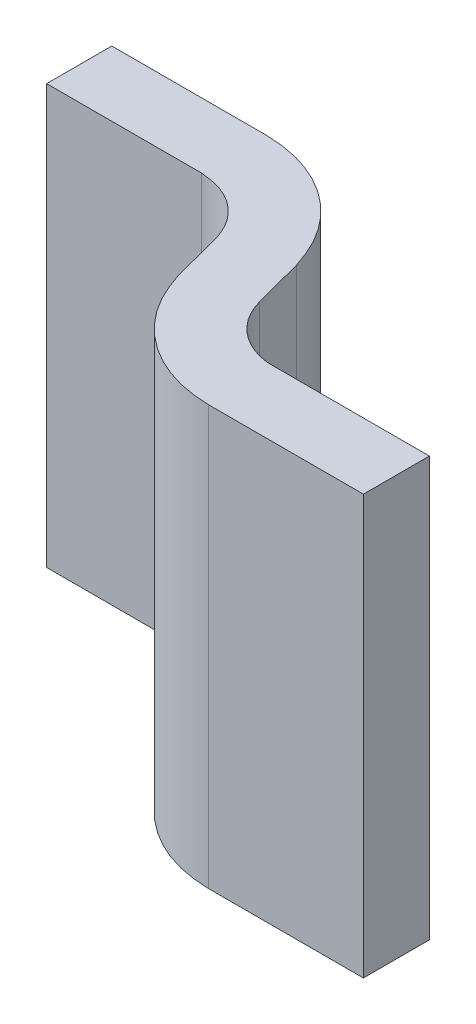
ISO-10303-21;
HEADER;
FILE_DESCRIPTION(('STEP AP214'),'2;1');
FILE_NAME('part.step','',(''),(''),'','','');
FILE_SCHEMA(('AUTOMOTIVE_DESIGN { 1 0 10303 214 1 1 1 1 }'));
ENDSEC;
DATA;
#1=APPLICATION_CONTEXT('core data for automotive mechanical design processes');
#2=APPLICATION_PROTOCOL_DEFINITION('international standard','automotive_design',2000,#1);
#3=PRODUCT_CONTEXT('',#1,'mechanical');
#4=PRODUCT('Part','Part','',(#3));
#5=PRODUCT_RELATED_PRODUCT_CATEGORY('part','',(#4));
#6=PRODUCT_DEFINITION_FORMATION('','',#4);
#7=PRODUCT_DEFINITION_CONTEXT('part definition',#1,'design');
#8=PRODUCT_DEFINITION('design','',#6,#7);
#9=PRODUCT_DEFINITION_SHAPE('','',#8);
#10=(LENGTH_UNIT() NAMED_UNIT(*) SI_UNIT(.MILLI.,.METRE.));
#11=(NAMED_UNIT(*) PLANE_ANGLE_UNIT() SI_UNIT($,.RADIAN.));
#12=(NAMED_UNIT(*) SI_UNIT($,.STERADIAN.) SOLID_ANGLE_UNIT());
#13=UNCERTAINTY_MEASURE_WITH_UNIT(LENGTH_MEASURE(1.E-05),#10,'distance_accuracy_value','');
#14=(GEOMETRIC_REPRESENTATION_CONTEXT(3) GLOBAL_UNCERTAINTY_ASSIGNED_CONTEXT((#13)) GLOBAL_UNIT_ASSIGNED_CONTEXT((#10,
#11,#12)) REPRESENTATION_CONTEXT('',''));
#15=CARTESIAN_POINT('',(0.,0.,0.));
#16=DIRECTION('',(0.,0.,1.));
#17=DIRECTION('',(1.,0.,0.));
#18=AXIS2_PLACEMENT_3D('',#15,#16,#17);
#19=CARTESIAN_POINT('',(-0.876,-0.254,0.238));
#20=DIRECTION('',(1.,0.,0.));
#21=DIRECTION('',(0.,0.,1.));
#22=AXIS2_PLACEMENT_3D('',#19,#20,#21);
#23=PLANE('',#22);
#24=DIRECTION('',(0.,-1.,0.));
#25=VECTOR('',#24,1.);
#26=CARTESIAN_POINT('',(-0.876,0.254,0.238));
#27=LINE('',#26,#25);
#28=CARTESIAN_POINT('',(-0.876,0.254,0.238));
#29=VERTEX_POINT('',#28);
#30=CARTESIAN_POINT('',(-0.876,-0.254,0.238));
#31=VERTEX_POINT('',#30);
#32=EDGE_CURVE('E11',#29,#31,#27,.T.);
#33=ORIENTED_EDGE('',*,*,#32,.F.);
#34=DIRECTION('',(0.,0.,-1.));
#35=VECTOR('',#34,1.);
#36=CARTESIAN_POINT('',(-0.876,0.254,0.318));
#37=LINE('',#36,#35);
#38=CARTESIAN_POINT('',(-0.876,0.254,0.318));
#39=VERTEX_POINT('',#38);
#40=EDGE_CURVE('E24',#39,#29,#37,.T.);
#41=ORIENTED_EDGE('',*,*,#40,.F.);
#42=DIRECTION('',(0.,1.,0.));
#43=VECTOR('',#42,1.);
#44=CARTESIAN_POINT('',(-0.876,-0.254,0.318));
#45=LINE('',#44,#43);
#46=CARTESIAN_POINT('',(-0.876,-0.254,0.318));
#47=VERTEX_POINT('',#46);
#48=EDGE_CURVE('E439',#47,#39,#45,.T.);
#49=ORIENTED_EDGE('',*,*,#48,.F.);
#50=DIRECTION('',(0.,0.,1.));
#51=VECTOR('',#50,1.);
#52=CARTESIAN_POINT('',(-0.876,-0.254,0.238));
#53=LINE('',#52,#51);
#54=EDGE_CURVE('E437',#31,#47,#53,.T.);
#55=ORIENTED_EDGE('',*,*,#54,.F.);
#56=EDGE_LOOP('',(#33,#41,#49,#55));
#57=FACE_BOUND('',#56,.T.);
#58=ADVANCED_FACE('F17',(#57),#23,.T.);
#59=CARTESIAN_POINT('',(-0.876,-0.254,0.318));
#60=DIRECTION('',(0.,0.,1.));
#61=DIRECTION('',(0.,1.,0.));
#62=AXIS2_PLACEMENT_3D('',#59,#60,#61);
#63=PLANE('',#62);
#64=ORIENTED_EDGE('',*,*,#48,.T.);
#65=DIRECTION('',(1.,0.,0.));
#66=VECTOR('',#65,1.);
#67=CARTESIAN_POINT('',(-1.064,0.254,0.318));
#68=LINE('',#67,#66);
#69=CARTESIAN_POINT('',(-1.064,0.254,0.318));
#70=VERTEX_POINT('',#69);
#71=EDGE_CURVE('E435',#70,#39,#68,.T.);
#72=ORIENTED_EDGE('',*,*,#71,.F.);
#73=CARTESIAN_POINT('',(-1.064,-0.254,0.31775));
#74=DIRECTION('',(0.,1.,0.));
#75=VECTOR('',#74,1.);
#76=LINE('',#73,#75);
#77=CARTESIAN_POINT('',(-1.064,-0.254,0.318));
#78=VERTEX_POINT('',#77);
#79=EDGE_CURVE('E257',#78,#70,#76,.T.);
#80=ORIENTED_EDGE('',*,*,#79,.F.);
#81=DIRECTION('',(-1.,0.,0.));
#82=VECTOR('',#81,1.);
#83=CARTESIAN_POINT('',(-0.876,-0.254,0.318));
#84=LINE('',#83,#82);
#85=EDGE_CURVE('E247',#47,#78,#84,.T.);
#86=ORIENTED_EDGE('',*,*,#85,.F.);
#87=EDGE_LOOP('',(#64,#72,#80,#86));
#88=FACE_BOUND('',#87,.T.);
#89=ADVANCED_FACE('F237',(#88),#63,.T.);
#90=CARTESIAN_POINT('',(-0.876,0.254,0.238));
#91=DIRECTION('',(0.,0.,-1.));
#92=DIRECTION('',(0.,1.,0.));
#93=AXIS2_PLACEMENT_3D('',#90,#91,#92);
#94=PLANE('',#93);
#95=ORIENTED_EDGE('',*,*,#32,.T.);
#96=DIRECTION('',(1.,0.,0.));
#97=VECTOR('',#96,1.);
#98=CARTESIAN_POINT('',(-1.064,-0.254,0.238));
#99=LINE('',#98,#97);
#100=CARTESIAN_POINT('',(-1.064,-0.254,0.238));
#101=VERTEX_POINT('',#100);
#102=EDGE_CURVE('E443',#101,#31,#99,.T.);
#103=ORIENTED_EDGE('',*,*,#102,.F.);
#104=CARTESIAN_POINT('',(-1.064,0.254,0.238375));
#105=DIRECTION('',(0.,-1.,0.));
#106=VECTOR('',#105,1.);
#107=LINE('',#104,#106);
#108=CARTESIAN_POINT('',(-1.064,0.254,0.238));
#109=VERTEX_POINT('',#108);
#110=EDGE_CURVE('E222',#109,#101,#107,.T.);
#111=ORIENTED_EDGE('',*,*,#110,.F.);
#112=DIRECTION('',(-1.,0.,0.));
#113=VECTOR('',#112,1.);
#114=CARTESIAN_POINT('',(-0.876,0.254,0.238));
#115=LINE('',#114,#113);
#116=EDGE_CURVE('E219',#29,#109,#115,.T.);
#117=ORIENTED_EDGE('',*,*,#116,.F.);
#118=EDGE_LOOP('',(#95,#103,#111,#117));
#119=FACE_BOUND('',#118,.T.);
#120=ADVANCED_FACE('F228',(#119),#94,.T.);
#121=CARTESIAN_POINT('',(-1.234,0.254,0.138));
#122=DIRECTION('',(-0.965885549343203,0.,0.258969313954337));
#123=DIRECTION('',(0.258969313954337,0.,0.965885549343203));
#124=AXIS2_PLACEMENT_3D('',#121,#122,#123);
#125=PLANE('',#124);
#126=CARTESIAN_POINT('',(-1.23442187168926,-0.254,0.138115055915251));
#127=DIRECTION('',(0.,1.,0.));
#128=VECTOR('',#127,1.);
#129=LINE('',#126,#128);
#130=CARTESIAN_POINT('',(-1.234,-0.254,0.138));
#131=VERTEX_POINT('',#130);
#132=CARTESIAN_POINT('',(-1.234,0.254,0.138));
#133=VERTEX_POINT('',#132);
#134=EDGE_CURVE('E215',#131,#133,#129,.T.);
#135=ORIENTED_EDGE('',*,*,#134,.F.);
#136=CARTESIAN_POINT('',(-1.218,-0.254,0.2));
#137=DIRECTION('',(-0.258969313954338,0.,-0.965885549343202));
#138=VECTOR('',#137,1.);
#139=LINE('',#136,#138);
#140=CARTESIAN_POINT('',(-1.218,-0.254,0.2));
#141=VERTEX_POINT('',#140);
#142=EDGE_CURVE('E301',#141,#131,#139,.T.);
#143=ORIENTED_EDGE('',*,*,#142,.F.);
#144=CARTESIAN_POINT('',(-1.21740631765688,0.254,0.199841941713844));
#145=DIRECTION('',(0.,-1.,0.));
#146=VECTOR('',#145,1.);
#147=LINE('',#144,#146);
#148=CARTESIAN_POINT('',(-1.218,0.254,0.2));
#149=VERTEX_POINT('',#148);
#150=EDGE_CURVE('E288',#149,#141,#147,.T.);
#151=ORIENTED_EDGE('',*,*,#150,.F.);
#152=DIRECTION('',(0.258969313954337,0.,0.965885549343203));
#153=VECTOR('',#152,1.);
#154=CARTESIAN_POINT('',(-1.234,0.254,0.138));
#155=LINE('',#154,#153);
#156=EDGE_CURVE('E356',#133,#149,#155,.T.);
#157=ORIENTED_EDGE('',*,*,#156,.F.);
#158=EDGE_LOOP('',(#135,#143,#151,#157));
#159=FACE_BOUND('',#158,.T.);
#160=ADVANCED_FACE('F236',(#159),#125,.T.);
#161=CARTESIAN_POINT('',(-1.157,-0.254,0.118));
#162=DIRECTION('',(0.965885549343203,0.,-0.258969313954337));
#163=DIRECTION('',(0.258969313954337,0.,0.965885549343203));
#164=AXIS2_PLACEMENT_3D('',#161,#162,#163);
#165=PLANE('',#164);
#166=CARTESIAN_POINT('',(-1.15759368234312,0.254,0.118158058286156));
#167=DIRECTION('',(0.,-1.,0.));
#168=VECTOR('',#167,1.);
#169=LINE('',#166,#168);
#170=CARTESIAN_POINT('',(-1.157,0.254,0.118));
#171=VERTEX_POINT('',#170);
#172=CARTESIAN_POINT('',(-1.157,-0.254,0.118));
#173=VERTEX_POINT('',#172);
#174=EDGE_CURVE('E342',#171,#173,#169,.T.);
#175=ORIENTED_EDGE('',*,*,#174,.F.);
#176=CARTESIAN_POINT('',(-1.141,0.254,0.179));
#177=DIRECTION('',(-0.258969313954335,0.,-0.965885549343203));
#178=VECTOR('',#177,1.);
#179=LINE('',#176,#178);
#180=CARTESIAN_POINT('',(-1.141,0.254,0.179));
#181=VERTEX_POINT('',#180);
#182=EDGE_CURVE('E330',#181,#171,#179,.T.);
#183=ORIENTED_EDGE('',*,*,#182,.F.);
#184=CARTESIAN_POINT('',(-1.14082576891933,-0.254,0.178954745173853));
#185=DIRECTION('',(0.,1.,0.));
#186=VECTOR('',#185,1.);
#187=LINE('',#184,#186);
#188=CARTESIAN_POINT('',(-1.141,-0.254,0.179));
#189=VERTEX_POINT('',#188);
#190=EDGE_CURVE('E366',#189,#181,#187,.T.);
#191=ORIENTED_EDGE('',*,*,#190,.F.);
#192=DIRECTION('',(0.258969313954337,0.,0.965885549343203));
#193=VECTOR('',#192,1.);
#194=CARTESIAN_POINT('',(-1.157,-0.254,0.118));
#195=LINE('',#194,#193);
#196=EDGE_CURVE('E368',#173,#189,#195,.T.);
#197=ORIENTED_EDGE('',*,*,#196,.F.);
#198=EDGE_LOOP('',(#175,#183,#191,#197));
#199=FACE_BOUND('',#198,.T.);
#200=ADVANCED_FACE('F160',(#199),#165,.T.);
#201=CARTESIAN_POINT('',(-1.499,0.254,0.079));
#202=DIRECTION('',(0.,0.,1.));
#203=DIRECTION('',(0.,1.,0.));
#204=AXIS2_PLACEMENT_3D('',#201,#202,#203);
#205=PLANE('',#204);
#206=DIRECTION('',(0.,1.,0.));
#207=VECTOR('',#206,1.);
#208=CARTESIAN_POINT('',(-1.499,-0.254,0.079));
#209=LINE('',#208,#207);
#210=CARTESIAN_POINT('',(-1.499,-0.254,0.079));
#211=VERTEX_POINT('',#210);
#212=CARTESIAN_POINT('',(-1.499,0.254,0.079));
#213=VERTEX_POINT('',#212);
#214=EDGE_CURVE('E125',#211,#213,#209,.T.);
#215=ORIENTED_EDGE('',*,*,#214,.F.);
#216=DIRECTION('',(-1.,0.,0.));
#217=VECTOR('',#216,1.);
#218=CARTESIAN_POINT('',(-1.311,-0.254,0.079));
#219=LINE('',#218,#217);
#220=CARTESIAN_POINT('',(-1.311,-0.254,0.079));
#221=VERTEX_POINT('',#220);
#222=EDGE_CURVE('E377',#221,#211,#219,.T.);
#223=ORIENTED_EDGE('',*,*,#222,.F.);
#224=CARTESIAN_POINT('',(-1.311,0.254,0.079625));
#225=DIRECTION('',(0.,-1.,0.));
#226=VECTOR('',#225,1.);
#227=LINE('',#224,#226);
#228=CARTESIAN_POINT('',(-1.311,0.254,0.079));
#229=VERTEX_POINT('',#228);
#230=EDGE_CURVE('E178',#229,#221,#227,.T.);
#231=ORIENTED_EDGE('',*,*,#230,.F.);
#232=DIRECTION('',(1.,0.,0.));
#233=VECTOR('',#232,1.);
#234=CARTESIAN_POINT('',(-1.499,0.254,0.079));
#235=LINE('',#234,#233);
#236=EDGE_CURVE('E169',#213,#229,#235,.T.);
#237=ORIENTED_EDGE('',*,*,#236,.F.);
#238=EDGE_LOOP('',(#215,#223,#231,#237));
#239=FACE_BOUND('',#238,.T.);
#240=ADVANCED_FACE('F155',(#239),#205,.T.);
#241=CARTESIAN_POINT('',(-1.311,0.254,0.));
#242=DIRECTION('',(0.,0.,-1.));
#243=DIRECTION('',(0.,1.,0.));
#244=AXIS2_PLACEMENT_3D('',#241,#242,#243);
#245=PLANE('',#244);
#246=CARTESIAN_POINT('',(-1.311,-0.254,0.000249999999999979));
#247=DIRECTION('',(0.,1.,0.));
#248=VECTOR('',#247,1.);
#249=LINE('',#246,#248);
#250=CARTESIAN_POINT('',(-1.311,-0.254,0.));
#251=VERTEX_POINT('',#250);
#252=CARTESIAN_POINT('',(-1.311,0.254,0.));
#253=VERTEX_POINT('',#252);
#254=EDGE_CURVE('E140',#251,#253,#249,.T.);
#255=ORIENTED_EDGE('',*,*,#254,.F.);
#256=DIRECTION('',(1.,0.,0.));
#257=VECTOR('',#256,1.);
#258=CARTESIAN_POINT('',(-1.499,-0.254,0.));
#259=LINE('',#258,#257);
#260=CARTESIAN_POINT('',(-1.499,-0.254,0.));
#261=VERTEX_POINT('',#260);
#262=EDGE_CURVE('E107',#261,#251,#259,.T.);
#263=ORIENTED_EDGE('',*,*,#262,.F.);
#264=DIRECTION('',(0.,-1.,0.));
#265=VECTOR('',#264,1.);
#266=CARTESIAN_POINT('',(-1.499,0.254,0.));
#267=LINE('',#266,#265);
#268=CARTESIAN_POINT('',(-1.499,0.254,0.));
#269=VERTEX_POINT('',#268);
#270=EDGE_CURVE('E101',#269,#261,#267,.T.);
#271=ORIENTED_EDGE('',*,*,#270,.F.);
#272=DIRECTION('',(-1.,0.,0.));
#273=VECTOR('',#272,1.);
#274=CARTESIAN_POINT('',(-1.311,0.254,0.));
#275=LINE('',#274,#273);
#276=EDGE_CURVE('E104',#253,#269,#275,.T.);
#277=ORIENTED_EDGE('',*,*,#276,.F.);
#278=EDGE_LOOP('',(#255,#263,#271,#277));
#279=FACE_BOUND('',#278,.T.);
#280=ADVANCED_FACE('F103',(#279),#245,.T.);
#281=CARTESIAN_POINT('',(-1.499,0.254,0.));
#282=DIRECTION('',(-1.,0.,0.));
#283=DIRECTION('',(0.,0.,1.));
#284=AXIS2_PLACEMENT_3D('',#281,#282,#283);
#285=PLANE('',#284);
#286=ORIENTED_EDGE('',*,*,#270,.T.);
#287=DIRECTION('',(0.,0.,-1.));
#288=VECTOR('',#287,1.);
#289=CARTESIAN_POINT('',(-1.499,-0.254,0.079));
#290=LINE('',#289,#288);
#291=EDGE_CURVE('E122',#211,#261,#290,.T.);
#292=ORIENTED_EDGE('',*,*,#291,.F.);
#293=ORIENTED_EDGE('',*,*,#214,.T.);
#294=DIRECTION('',(0.,0.,1.));
#295=VECTOR('',#294,1.);
#296=CARTESIAN_POINT('',(-1.499,0.254,0.));
#297=LINE('',#296,#295);
#298=EDGE_CURVE('E118',#269,#213,#297,.T.);
#299=ORIENTED_EDGE('',*,*,#298,.F.);
#300=EDGE_LOOP('',(#286,#292,#293,#299));
#301=FACE_BOUND('',#300,.T.);
#302=ADVANCED_FACE('F124',(#301),#285,.T.);
#303=CARTESIAN_POINT('',(-1.064,-0.254,0.159));
#304=DIRECTION('',(0.,-1.,0.));
#305=DIRECTION('',(0.,0.,1.));
#306=AXIS2_PLACEMENT_3D('',#303,#304,#305);
#307=CYLINDRICAL_SURFACE('',#306,0.15875);
#308=ORIENTED_EDGE('',*,*,#79,.T.);
#309=CARTESIAN_POINT('',(-1.064,0.254,0.159));
#310=DIRECTION('',(0.,1.,0.));
#311=DIRECTION('',(0.793107076683516,0.,0.609082231652284));
#312=AXIS2_PLACEMENT_3D('',#309,#310,#311);
#313=CIRCLE('',#312,0.15875);
#314=EDGE_CURVE('E127',#149,#70,#313,.T.);
#315=ORIENTED_EDGE('',*,*,#314,.F.);
#316=ORIENTED_EDGE('',*,*,#150,.T.);
#317=CARTESIAN_POINT('',(-1.064,-0.254,0.159));
#318=DIRECTION('',(0.,-1.,0.));
#319=DIRECTION('',(-0.793107076683516,0.,-0.609082231652284));
#320=AXIS2_PLACEMENT_3D('',#317,#318,#319);
#321=CIRCLE('',#320,0.15875);
#322=EDGE_CURVE('E131',#78,#141,#321,.T.);
#323=ORIENTED_EDGE('',*,*,#322,.F.);
#324=EDGE_LOOP('',(#308,#315,#316,#323));
#325=FACE_BOUND('',#324,.T.);
#326=ADVANCED_FACE('F263',(#325),#307,.T.);
#327=CARTESIAN_POINT('',(-1.064,0.254,0.159));
#328=DIRECTION('',(0.,-1.,0.));
#329=DIRECTION('',(0.,0.,-1.));
#330=AXIS2_PLACEMENT_3D('',#327,#328,#329);
#331=CYLINDRICAL_SURFACE('',#330,0.079375);
#332=ORIENTED_EDGE('',*,*,#110,.T.);
#333=CARTESIAN_POINT('',(-1.064,-0.254,0.159));
#334=DIRECTION('',(0.,1.,0.));
#335=DIRECTION('',(0.793107076683516,0.,0.609082231652284));
#336=AXIS2_PLACEMENT_3D('',#333,#334,#335);
#337=CIRCLE('',#336,0.079375);
#338=EDGE_CURVE('E427',#189,#101,#337,.T.);
#339=ORIENTED_EDGE('',*,*,#338,.F.);
#340=ORIENTED_EDGE('',*,*,#190,.T.);
#341=CARTESIAN_POINT('',(-1.064,0.254,0.159));
#342=DIRECTION('',(0.,-1.,0.));
#343=DIRECTION('',(-0.793107076683516,0.,-0.609082231652284));
#344=AXIS2_PLACEMENT_3D('',#341,#342,#343);
#345=CIRCLE('',#344,0.079375);
#346=EDGE_CURVE('E423',#109,#181,#345,.T.);
#347=ORIENTED_EDGE('',*,*,#346,.F.);
#348=EDGE_LOOP('',(#332,#339,#340,#347));
#349=FACE_BOUND('',#348,.T.);
#350=ADVANCED_FACE('F195',(#349),#331,.F.);
#351=CARTESIAN_POINT('',(-1.311,0.254,0.159));
#352=DIRECTION('',(0.,-1.,0.));
#353=DIRECTION('',(0.,0.,1.));
#354=AXIS2_PLACEMENT_3D('',#351,#352,#353);
#355=CYLINDRICAL_SURFACE('',#354,0.079375);
#356=ORIENTED_EDGE('',*,*,#230,.T.);
#357=CARTESIAN_POINT('',(-1.311,-0.254,0.159));
#358=DIRECTION('',(0.,1.,0.));
#359=DIRECTION('',(-0.793107076683516,0.,-0.609082231652284));
#360=AXIS2_PLACEMENT_3D('',#357,#358,#359);
#361=CIRCLE('',#360,0.079375);
#362=EDGE_CURVE('E418',#131,#221,#361,.T.);
#363=ORIENTED_EDGE('',*,*,#362,.F.);
#364=ORIENTED_EDGE('',*,*,#134,.T.);
#365=CARTESIAN_POINT('',(-1.311,0.254,0.159));
#366=DIRECTION('',(0.,-1.,0.));
#367=DIRECTION('',(0.793107076683516,0.,0.609082231652284));
#368=AXIS2_PLACEMENT_3D('',#365,#366,#367);
#369=CIRCLE('',#368,0.079375);
#370=EDGE_CURVE('E408',#229,#133,#369,.T.);
#371=ORIENTED_EDGE('',*,*,#370,.F.);
#372=EDGE_LOOP('',(#356,#363,#364,#371));
#373=FACE_BOUND('',#372,.T.);
#374=ADVANCED_FACE('F184',(#373),#355,.F.);
#375=CARTESIAN_POINT('',(-1.311,0.254,0.159));
#376=DIRECTION('',(0.,-1.,0.));
#377=DIRECTION('',(0.,0.,-1.));
#378=AXIS2_PLACEMENT_3D('',#375,#376,#377);
#379=CYLINDRICAL_SURFACE('',#378,0.15875);
#380=ORIENTED_EDGE('',*,*,#254,.T.);
#381=CARTESIAN_POINT('',(-1.311,0.254,0.159));
#382=DIRECTION('',(0.,1.,0.));
#383=DIRECTION('',(-0.793107076683516,0.,-0.609082231652284));
#384=AXIS2_PLACEMENT_3D('',#381,#382,#383);
#385=CIRCLE('',#384,0.15875);
#386=EDGE_CURVE('E121',#171,#253,#385,.T.);
#387=ORIENTED_EDGE('',*,*,#386,.F.);
#388=ORIENTED_EDGE('',*,*,#174,.T.);
#389=CARTESIAN_POINT('',(-1.311,-0.254,0.159));
#390=DIRECTION('',(0.,-1.,0.));
#391=DIRECTION('',(0.793107076683516,0.,0.609082231652284));
#392=AXIS2_PLACEMENT_3D('',#389,#390,#391);
#393=CIRCLE('',#392,0.15875);
#394=EDGE_CURVE('E405',#251,#173,#393,.T.);
#395=ORIENTED_EDGE('',*,*,#394,.F.);
#396=EDGE_LOOP('',(#380,#387,#388,#395));
#397=FACE_BOUND('',#396,.T.);
#398=ADVANCED_FACE('F194',(#397),#379,.T.);
#399=CARTESIAN_POINT('',(-0.876,0.254,0.238));
#400=DIRECTION('',(0.,1.,0.));
#401=DIRECTION('',(1.,0.,0.));
#402=AXIS2_PLACEMENT_3D('',#399,#400,#401);
#403=PLANE('',#402);
#404=ORIENTED_EDGE('',*,*,#71,.T.);
#405=ORIENTED_EDGE('',*,*,#40,.T.);
#406=ORIENTED_EDGE('',*,*,#116,.T.);
#407=ORIENTED_EDGE('',*,*,#346,.T.);
#408=ORIENTED_EDGE('',*,*,#182,.T.);
#409=ORIENTED_EDGE('',*,*,#386,.T.);
#410=ORIENTED_EDGE('',*,*,#276,.T.);
#411=ORIENTED_EDGE('',*,*,#298,.T.);
#412=ORIENTED_EDGE('',*,*,#236,.T.);
#413=ORIENTED_EDGE('',*,*,#370,.T.);
#414=ORIENTED_EDGE('',*,*,#156,.T.);
#415=ORIENTED_EDGE('',*,*,#314,.T.);
#416=EDGE_LOOP('',(#404,#405,#406,#407,#408,#409,#410,#411,#412,#413,#414,#415));
#417=FACE_BOUND('',#416,.T.);
#418=ADVANCED_FACE('F116',(#417),#403,.T.);
#419=CARTESIAN_POINT('',(-1.311,-0.254,0.079));
#420=DIRECTION('',(0.,-1.,0.));
#421=DIRECTION('',(1.,0.,0.));
#422=AXIS2_PLACEMENT_3D('',#419,#420,#421);
#423=PLANE('',#422);
#424=ORIENTED_EDGE('',*,*,#102,.T.);
#425=ORIENTED_EDGE('',*,*,#54,.T.);
#426=ORIENTED_EDGE('',*,*,#85,.T.);
#427=ORIENTED_EDGE('',*,*,#322,.T.);
#428=ORIENTED_EDGE('',*,*,#142,.T.);
#429=ORIENTED_EDGE('',*,*,#362,.T.);
#430=ORIENTED_EDGE('',*,*,#222,.T.);
#431=ORIENTED_EDGE('',*,*,#291,.T.);
#432=ORIENTED_EDGE('',*,*,#262,.T.);
#433=ORIENTED_EDGE('',*,*,#394,.T.);
#434=ORIENTED_EDGE('',*,*,#196,.T.);
#435=ORIENTED_EDGE('',*,*,#338,.T.);
#436=EDGE_LOOP('',(#424,#425,#426,#427,#428,#429,#430,#431,#432,#433,#434,#435));
#437=FACE_BOUND('',#436,.T.);
#438=ADVANCED_FACE('F306',(#437),#423,.T.);
#439=CLOSED_SHELL('',(#58,#89,#120,#160,#200,#240,#280,#302,#326,#350,#374,#398,#418,#438));
#440=MANIFOLD_SOLID_BREP('B1',#439);
#441=ADVANCED_BREP_SHAPE_REPRESENTATION('',(#18,#440),#14);
#442=SHAPE_DEFINITION_REPRESENTATION(#9,#441);
ENDSEC;
END-ISO-10303-21;
